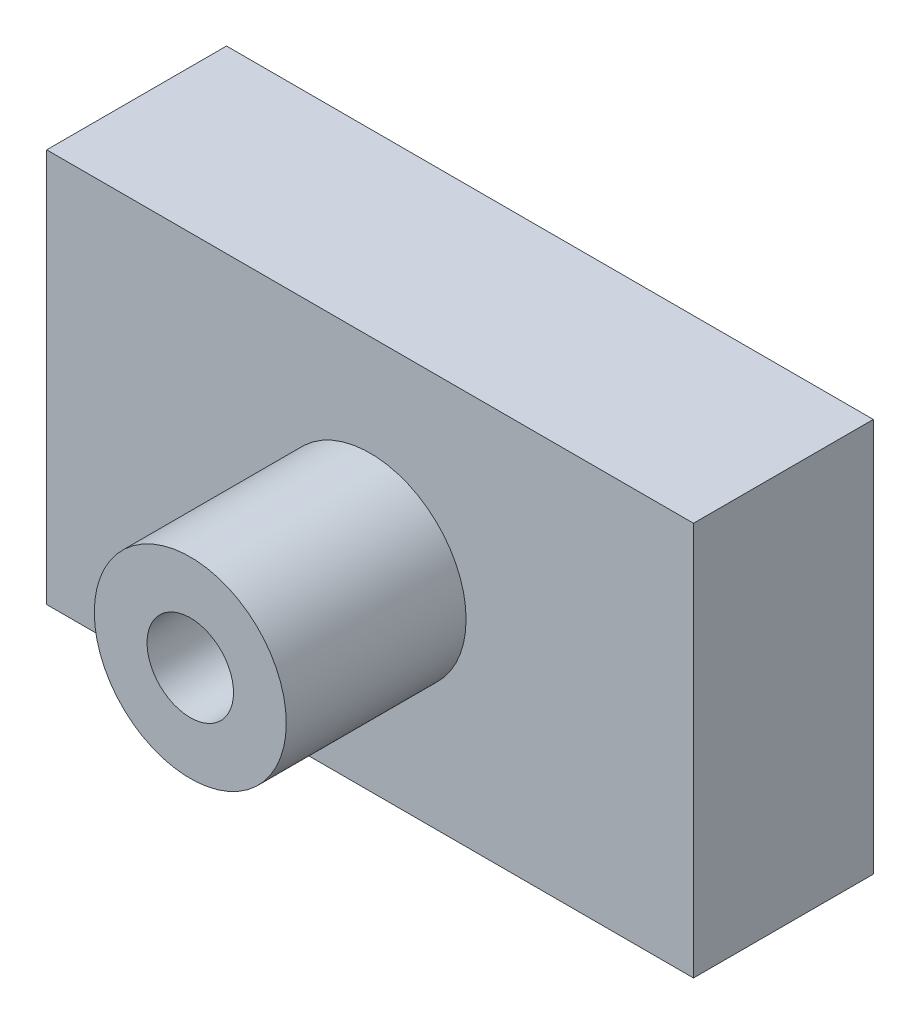
ISO-10303-21;
HEADER;
FILE_DESCRIPTION(('STEP AP214'),'2;1');
FILE_NAME('part.step','',(''),(''),'','','');
FILE_SCHEMA(('AUTOMOTIVE_DESIGN { 1 0 10303 214 1 1 1 1 }'));
ENDSEC;
DATA;
#1=APPLICATION_CONTEXT('core data for automotive mechanical design processes');
#2=APPLICATION_PROTOCOL_DEFINITION('international standard','automotive_design',2000,#1);
#3=PRODUCT_CONTEXT('',#1,'mechanical');
#4=PRODUCT('Part','Part','',(#3));
#5=PRODUCT_RELATED_PRODUCT_CATEGORY('part','',(#4));
#6=PRODUCT_DEFINITION_FORMATION('','',#4);
#7=PRODUCT_DEFINITION_CONTEXT('part definition',#1,'design');
#8=PRODUCT_DEFINITION('design','',#6,#7);
#9=PRODUCT_DEFINITION_SHAPE('','',#8);
#10=(LENGTH_UNIT() NAMED_UNIT(*) SI_UNIT(.MILLI.,.METRE.));
#11=(NAMED_UNIT(*) PLANE_ANGLE_UNIT() SI_UNIT($,.RADIAN.));
#12=(NAMED_UNIT(*) SI_UNIT($,.STERADIAN.) SOLID_ANGLE_UNIT());
#13=UNCERTAINTY_MEASURE_WITH_UNIT(LENGTH_MEASURE(1.E-05),#10,'distance_accuracy_value','');
#14=(GEOMETRIC_REPRESENTATION_CONTEXT(3) GLOBAL_UNCERTAINTY_ASSIGNED_CONTEXT((#13)) GLOBAL_UNIT_ASSIGNED_CONTEXT((#10,
#11,#12)) REPRESENTATION_CONTEXT('',''));
#15=CARTESIAN_POINT('',(0.,0.,0.));
#16=DIRECTION('',(0.,0.,1.));
#17=DIRECTION('',(1.,0.,0.));
#18=AXIS2_PLACEMENT_3D('',#15,#16,#17);
#19=CARTESIAN_POINT('',(28.7761994278709,17.5215080960814,16.));
#20=DIRECTION('',(-1.,0.,0.));
#21=DIRECTION('',(0.,0.,1.));
#22=AXIS2_PLACEMENT_3D('',#19,#20,#21);
#23=PLANE('',#22);
#24=DIRECTION('',(0.,1.,0.));
#25=VECTOR('',#24,1.);
#26=CARTESIAN_POINT('',(28.7761994278709,17.5215080960814,0.));
#27=LINE('',#26,#25);
#28=CARTESIAN_POINT('',(28.7761994278709,-17.5215080960814,0.));
#29=VERTEX_POINT('',#28);
#30=CARTESIAN_POINT('',(28.7761994278709,17.5215080960814,0.));
#31=VERTEX_POINT('',#30);
#32=EDGE_CURVE('E116',#29,#31,#27,.T.);
#33=ORIENTED_EDGE('',*,*,#32,.T.);
#34=DIRECTION('',(0.,0.,-1.));
#35=VECTOR('',#34,1.);
#36=CARTESIAN_POINT('',(28.7761994278709,17.5215080960814,16.));
#37=LINE('',#36,#35);
#38=CARTESIAN_POINT('',(28.7761994278709,17.5215080960814,16.));
#39=VERTEX_POINT('',#38);
#40=EDGE_CURVE('E48',#39,#31,#37,.T.);
#41=ORIENTED_EDGE('',*,*,#40,.F.);
#42=DIRECTION('',(0.,1.,0.));
#43=VECTOR('',#42,1.);
#44=CARTESIAN_POINT('',(28.7761994278709,17.5215080960814,16.));
#45=LINE('',#44,#43);
#46=CARTESIAN_POINT('',(28.7761994278709,-17.5215080960814,16.));
#47=VERTEX_POINT('',#46);
#48=EDGE_CURVE('E99',#47,#39,#45,.T.);
#49=ORIENTED_EDGE('',*,*,#48,.F.);
#50=DIRECTION('',(0.,0.,-1.));
#51=VECTOR('',#50,1.);
#52=CARTESIAN_POINT('',(28.7761994278709,-17.5215080960814,16.));
#53=LINE('',#52,#51);
#54=EDGE_CURVE('E112',#47,#29,#53,.T.);
#55=ORIENTED_EDGE('',*,*,#54,.T.);
#56=EDGE_LOOP('',(#33,#41,#49,#55));
#57=FACE_BOUND('',#56,.T.);
#58=ADVANCED_FACE('F45',(#57),#23,.F.);
#59=CARTESIAN_POINT('',(-28.7761994278709,17.5215080960814,16.));
#60=DIRECTION('',(0.,-1.,0.));
#61=DIRECTION('',(0.,0.,-1.));
#62=AXIS2_PLACEMENT_3D('',#59,#60,#61);
#63=PLANE('',#62);
#64=DIRECTION('',(-1.,0.,0.));
#65=VECTOR('',#64,1.);
#66=CARTESIAN_POINT('',(-28.7761994278709,17.5215080960814,0.));
#67=LINE('',#66,#65);
#68=CARTESIAN_POINT('',(-28.7761994278709,17.5215080960814,0.));
#69=VERTEX_POINT('',#68);
#70=EDGE_CURVE('E105',#31,#69,#67,.T.);
#71=ORIENTED_EDGE('',*,*,#70,.T.);
#72=DIRECTION('',(0.,0.,-1.));
#73=VECTOR('',#72,1.);
#74=CARTESIAN_POINT('',(-28.7761994278709,17.5215080960814,16.));
#75=LINE('',#74,#73);
#76=CARTESIAN_POINT('',(-28.7761994278709,17.5215080960814,16.));
#77=VERTEX_POINT('',#76);
#78=EDGE_CURVE('E103',#77,#69,#75,.T.);
#79=ORIENTED_EDGE('',*,*,#78,.F.);
#80=DIRECTION('',(-1.,0.,0.));
#81=VECTOR('',#80,1.);
#82=CARTESIAN_POINT('',(-28.7761994278709,17.5215080960814,16.));
#83=LINE('',#82,#81);
#84=EDGE_CURVE('E94',#39,#77,#83,.T.);
#85=ORIENTED_EDGE('',*,*,#84,.F.);
#86=ORIENTED_EDGE('',*,*,#40,.T.);
#87=EDGE_LOOP('',(#71,#79,#85,#86));
#88=FACE_BOUND('',#87,.T.);
#89=ADVANCED_FACE('F104',(#88),#63,.F.);
#90=CARTESIAN_POINT('',(-28.7761994278709,17.5215080960814,16.));
#91=DIRECTION('',(1.,0.,0.));
#92=DIRECTION('',(0.,0.,-1.));
#93=AXIS2_PLACEMENT_3D('',#90,#91,#92);
#94=PLANE('',#93);
#95=DIRECTION('',(0.,-1.,0.));
#96=VECTOR('',#95,1.);
#97=CARTESIAN_POINT('',(-28.7761994278709,17.5215080960814,0.));
#98=LINE('',#97,#96);
#99=CARTESIAN_POINT('',(-28.7761994278709,-17.5215080960814,0.));
#100=VERTEX_POINT('',#99);
#101=EDGE_CURVE('E80',#69,#100,#98,.T.);
#102=ORIENTED_EDGE('',*,*,#101,.T.);
#103=DIRECTION('',(0.,0.,-1.));
#104=VECTOR('',#103,1.);
#105=CARTESIAN_POINT('',(-28.7761994278709,-17.5215080960814,16.));
#106=LINE('',#105,#104);
#107=CARTESIAN_POINT('',(-28.7761994278709,-17.5215080960814,16.));
#108=VERTEX_POINT('',#107);
#109=EDGE_CURVE('E107',#108,#100,#106,.T.);
#110=ORIENTED_EDGE('',*,*,#109,.F.);
#111=DIRECTION('',(0.,-1.,0.));
#112=VECTOR('',#111,1.);
#113=CARTESIAN_POINT('',(-28.7761994278709,17.5215080960814,16.));
#114=LINE('',#113,#112);
#115=EDGE_CURVE('E97',#77,#108,#114,.T.);
#116=ORIENTED_EDGE('',*,*,#115,.F.);
#117=ORIENTED_EDGE('',*,*,#78,.T.);
#118=EDGE_LOOP('',(#102,#110,#116,#117));
#119=FACE_BOUND('',#118,.T.);
#120=ADVANCED_FACE('F108',(#119),#94,.F.);
#121=CARTESIAN_POINT('',(-28.7761994278709,-17.5215080960814,16.));
#122=DIRECTION('',(0.,1.,0.));
#123=DIRECTION('',(0.,0.,1.));
#124=AXIS2_PLACEMENT_3D('',#121,#122,#123);
#125=PLANE('',#124);
#126=DIRECTION('',(1.,0.,0.));
#127=VECTOR('',#126,1.);
#128=CARTESIAN_POINT('',(-28.7761994278709,-17.5215080960814,0.));
#129=LINE('',#128,#127);
#130=EDGE_CURVE('E86',#100,#29,#129,.T.);
#131=ORIENTED_EDGE('',*,*,#130,.T.);
#132=ORIENTED_EDGE('',*,*,#54,.F.);
#133=DIRECTION('',(1.,0.,0.));
#134=VECTOR('',#133,1.);
#135=CARTESIAN_POINT('',(-28.7761994278709,-17.5215080960814,16.));
#136=LINE('',#135,#134);
#137=EDGE_CURVE('E63',#108,#47,#136,.T.);
#138=ORIENTED_EDGE('',*,*,#137,.F.);
#139=ORIENTED_EDGE('',*,*,#109,.T.);
#140=EDGE_LOOP('',(#131,#132,#138,#139));
#141=FACE_BOUND('',#140,.T.);
#142=ADVANCED_FACE('F130',(#141),#125,.F.);
#143=CARTESIAN_POINT('',(0.,0.,16.));
#144=DIRECTION('',(0.,0.,1.));
#145=DIRECTION('',(1.,0.,0.));
#146=AXIS2_PLACEMENT_3D('',#143,#144,#145);
#147=PLANE('',#146);
#148=CARTESIAN_POINT('',(0.,0.,16.));
#149=DIRECTION('',(0.,0.,1.));
#150=DIRECTION('',(1.,0.,0.));
#151=AXIS2_PLACEMENT_3D('',#148,#149,#150);
#152=CIRCLE('',#151,8.54088082714478);
#153=CARTESIAN_POINT('',(8.54088082714478,0.,16.));
#154=VERTEX_POINT('',#153);
#155=EDGE_CURVE('E11',#154,#154,#152,.T.);
#156=ORIENTED_EDGE('',*,*,#155,.F.);
#157=EDGE_LOOP('',(#156));
#158=FACE_BOUND('',#157,.T.);
#159=ORIENTED_EDGE('',*,*,#48,.T.);
#160=ORIENTED_EDGE('',*,*,#84,.T.);
#161=ORIENTED_EDGE('',*,*,#115,.T.);
#162=ORIENTED_EDGE('',*,*,#137,.T.);
#163=EDGE_LOOP('',(#159,#160,#161,#162));
#164=FACE_BOUND('',#163,.T.);
#165=ADVANCED_FACE('F95',(#158,#164),#147,.T.);
#166=CARTESIAN_POINT('',(0.,0.,0.));
#167=DIRECTION('',(0.,0.,1.));
#168=DIRECTION('',(1.,0.,0.));
#169=AXIS2_PLACEMENT_3D('',#166,#167,#168);
#170=PLANE('',#169);
#171=CARTESIAN_POINT('',(0.,0.,0.));
#172=DIRECTION('',(0.,0.,1.));
#173=DIRECTION('',(1.,0.,0.));
#174=AXIS2_PLACEMENT_3D('',#171,#172,#173);
#175=CIRCLE('',#174,3.84703817745933);
#176=CARTESIAN_POINT('',(3.84703817745933,0.,0.));
#177=VERTEX_POINT('',#176);
#178=EDGE_CURVE('E140',#177,#177,#175,.T.);
#179=ORIENTED_EDGE('',*,*,#178,.T.);
#180=EDGE_LOOP('',(#179));
#181=FACE_BOUND('',#180,.T.);
#182=ORIENTED_EDGE('',*,*,#32,.F.);
#183=ORIENTED_EDGE('',*,*,#130,.F.);
#184=ORIENTED_EDGE('',*,*,#101,.F.);
#185=ORIENTED_EDGE('',*,*,#70,.F.);
#186=EDGE_LOOP('',(#182,#183,#184,#185));
#187=FACE_BOUND('',#186,.T.);
#188=ADVANCED_FACE('F133',(#181,#187),#170,.F.);
#189=CARTESIAN_POINT('',(0.,0.,32.));
#190=DIRECTION('',(0.,0.,-1.));
#191=DIRECTION('',(-1.,0.,0.));
#192=AXIS2_PLACEMENT_3D('',#189,#190,#191);
#193=CYLINDRICAL_SURFACE('',#192,8.54088082714478);
#194=CARTESIAN_POINT('',(0.,0.,32.));
#195=DIRECTION('',(0.,0.,1.));
#196=DIRECTION('',(1.,0.,0.));
#197=AXIS2_PLACEMENT_3D('',#194,#195,#196);
#198=CIRCLE('',#197,8.54088082714478);
#199=CARTESIAN_POINT('',(8.54088082714478,0.,32.));
#200=VERTEX_POINT('',#199);
#201=EDGE_CURVE('E120',#200,#200,#198,.T.);
#202=ORIENTED_EDGE('',*,*,#201,.F.);
#203=EDGE_LOOP('',(#202));
#204=FACE_BOUND('',#203,.T.);
#205=ORIENTED_EDGE('',*,*,#155,.T.);
#206=EDGE_LOOP('',(#205));
#207=FACE_BOUND('',#206,.T.);
#208=ADVANCED_FACE('F155',(#204,#207),#193,.T.);
#209=CARTESIAN_POINT('',(0.,0.,32.));
#210=DIRECTION('',(0.,0.,1.));
#211=DIRECTION('',(1.,0.,0.));
#212=AXIS2_PLACEMENT_3D('',#209,#210,#211);
#213=PLANE('',#212);
#214=CARTESIAN_POINT('',(0.,0.,32.));
#215=DIRECTION('',(0.,0.,1.));
#216=DIRECTION('',(1.,0.,0.));
#217=AXIS2_PLACEMENT_3D('',#214,#215,#216);
#218=CIRCLE('',#217,3.84703817745933);
#219=CARTESIAN_POINT('',(3.84703817745933,0.,32.));
#220=VERTEX_POINT('',#219);
#221=EDGE_CURVE('E144',#220,#220,#218,.T.);
#222=ORIENTED_EDGE('',*,*,#221,.F.);
#223=EDGE_LOOP('',(#222));
#224=FACE_BOUND('',#223,.T.);
#225=ORIENTED_EDGE('',*,*,#201,.T.);
#226=EDGE_LOOP('',(#225));
#227=FACE_BOUND('',#226,.T.);
#228=ADVANCED_FACE('F152',(#224,#227),#213,.T.);
#229=CARTESIAN_POINT('',(0.,0.,-7.00000000000001));
#230=DIRECTION('',(0.,0.,1.));
#231=DIRECTION('',(1.,0.,0.));
#232=AXIS2_PLACEMENT_3D('',#229,#230,#231);
#233=CYLINDRICAL_SURFACE('',#232,3.84703817745933);
#234=ORIENTED_EDGE('',*,*,#221,.T.);
#235=EDGE_LOOP('',(#234));
#236=FACE_BOUND('',#235,.T.);
#237=ORIENTED_EDGE('',*,*,#178,.F.);
#238=EDGE_LOOP('',(#237));
#239=FACE_BOUND('',#238,.T.);
#240=ADVANCED_FACE('F149',(#236,#239),#233,.F.);
#241=CLOSED_SHELL('',(#58,#89,#120,#142,#165,#188,#208,#228,#240));
#242=MANIFOLD_SOLID_BREP('B2',#241);
#243=ADVANCED_BREP_SHAPE_REPRESENTATION('',(#18,#242),#14);
#244=SHAPE_DEFINITION_REPRESENTATION(#9,#243);
ENDSEC;
END-ISO-10303-21;
